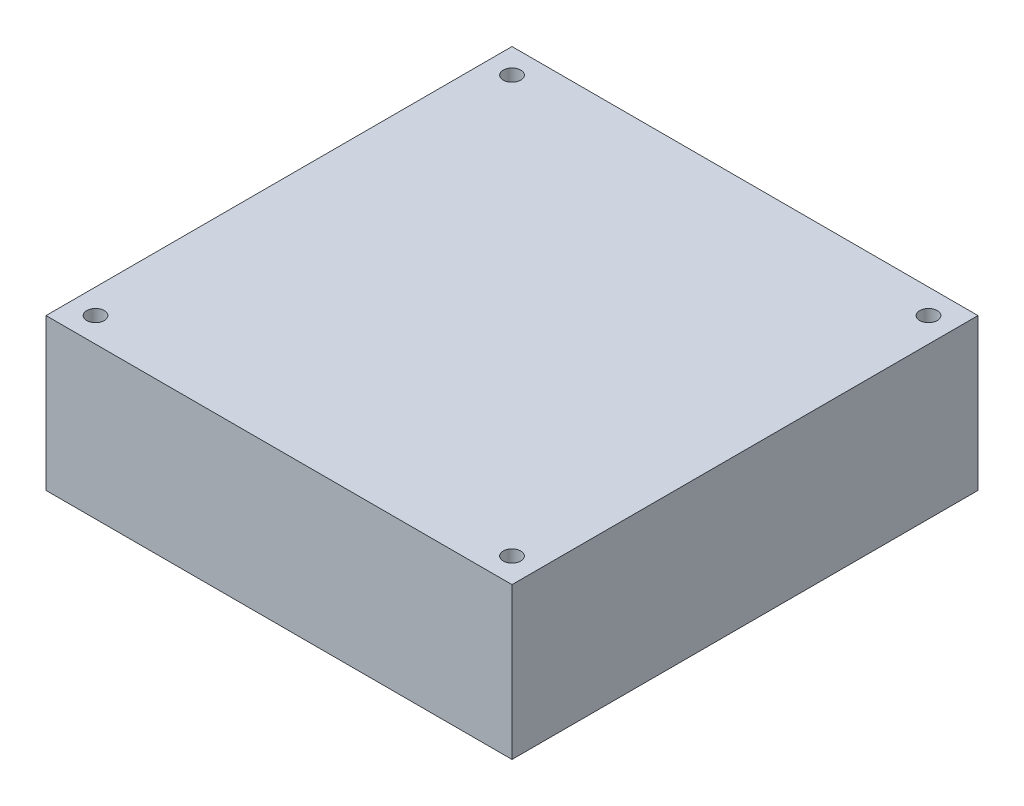
ISO-10303-21;
HEADER;
FILE_DESCRIPTION(('STEP AP214'),'2;1');
FILE_NAME('part.step','',(''),(''),'','','');
FILE_SCHEMA(('AUTOMOTIVE_DESIGN { 1 0 10303 214 1 1 1 1 }'));
ENDSEC;
DATA;
#1=APPLICATION_CONTEXT('core data for automotive mechanical design processes');
#2=APPLICATION_PROTOCOL_DEFINITION('international standard','automotive_design',2000,#1);
#3=PRODUCT_CONTEXT('',#1,'mechanical');
#4=PRODUCT('Part','Part','',(#3));
#5=PRODUCT_RELATED_PRODUCT_CATEGORY('part','',(#4));
#6=PRODUCT_DEFINITION_FORMATION('','',#4);
#7=PRODUCT_DEFINITION_CONTEXT('part definition',#1,'design');
#8=PRODUCT_DEFINITION('design','',#6,#7);
#9=PRODUCT_DEFINITION_SHAPE('','',#8);
#10=(LENGTH_UNIT() NAMED_UNIT(*) SI_UNIT(.MILLI.,.METRE.));
#11=(NAMED_UNIT(*) PLANE_ANGLE_UNIT() SI_UNIT($,.RADIAN.));
#12=(NAMED_UNIT(*) SI_UNIT($,.STERADIAN.) SOLID_ANGLE_UNIT());
#13=UNCERTAINTY_MEASURE_WITH_UNIT(LENGTH_MEASURE(1.E-05),#10,'distance_accuracy_value','');
#14=(GEOMETRIC_REPRESENTATION_CONTEXT(3) GLOBAL_UNCERTAINTY_ASSIGNED_CONTEXT((#13)) GLOBAL_UNIT_ASSIGNED_CONTEXT((#10,
#11,#12)) REPRESENTATION_CONTEXT('',''));
#15=CARTESIAN_POINT('',(0.,0.,0.));
#16=DIRECTION('',(0.,0.,1.));
#17=DIRECTION('',(1.,0.,0.));
#18=AXIS2_PLACEMENT_3D('',#15,#16,#17);
#19=CARTESIAN_POINT('',(0.,26.,0.));
#20=DIRECTION('',(0.,-1.,0.));
#21=DIRECTION('',(0.,0.,-1.));
#22=AXIS2_PLACEMENT_3D('',#19,#20,#21);
#23=PLANE('',#22);
#24=DIRECTION('',(0.,0.,-1.));
#25=VECTOR('',#24,1.);
#26=CARTESIAN_POINT('',(40.,26.,40.));
#27=LINE('',#26,#25);
#28=CARTESIAN_POINT('',(40.,26.,40.));
#29=VERTEX_POINT('',#28);
#30=CARTESIAN_POINT('',(40.,26.,-40.));
#31=VERTEX_POINT('',#30);
#32=EDGE_CURVE('E88',#29,#31,#27,.T.);
#33=ORIENTED_EDGE('',*,*,#32,.T.);
#34=DIRECTION('',(-1.,0.,0.));
#35=VECTOR('',#34,1.);
#36=CARTESIAN_POINT('',(-40.,26.,-40.));
#37=LINE('',#36,#35);
#38=CARTESIAN_POINT('',(-40.,26.,-40.));
#39=VERTEX_POINT('',#38);
#40=EDGE_CURVE('E83',#31,#39,#37,.T.);
#41=ORIENTED_EDGE('',*,*,#40,.T.);
#42=DIRECTION('',(0.,0.,1.));
#43=VECTOR('',#42,1.);
#44=CARTESIAN_POINT('',(-40.,26.,40.));
#45=LINE('',#44,#43);
#46=CARTESIAN_POINT('',(-40.,26.,40.));
#47=VERTEX_POINT('',#46);
#48=EDGE_CURVE('E86',#39,#47,#45,.T.);
#49=ORIENTED_EDGE('',*,*,#48,.T.);
#50=DIRECTION('',(1.,0.,0.));
#51=VECTOR('',#50,1.);
#52=CARTESIAN_POINT('',(-40.,26.,40.));
#53=LINE('',#52,#51);
#54=EDGE_CURVE('E53',#47,#29,#53,.T.);
#55=ORIENTED_EDGE('',*,*,#54,.T.);
#56=EDGE_LOOP('',(#33,#41,#49,#55));
#57=FACE_BOUND('',#56,.T.);
#58=CARTESIAN_POINT('',(35.75,26.,-35.75));
#59=DIRECTION('',(0.,1.,0.));
#60=DIRECTION('',(0.,0.,1.));
#61=AXIS2_PLACEMENT_3D('',#58,#59,#60);
#62=CIRCLE('',#61,1.5);
#63=CARTESIAN_POINT('',(35.75,26.,-34.25));
#64=VERTEX_POINT('',#63);
#65=EDGE_CURVE('E103',#64,#64,#62,.T.);
#66=ORIENTED_EDGE('',*,*,#65,.F.);
#67=EDGE_LOOP('',(#66));
#68=FACE_BOUND('',#67,.T.);
#69=CARTESIAN_POINT('',(-35.75,26.,-35.75));
#70=DIRECTION('',(0.,1.,0.));
#71=DIRECTION('',(0.,0.,1.));
#72=AXIS2_PLACEMENT_3D('',#69,#70,#71);
#73=CIRCLE('',#72,1.5);
#74=CARTESIAN_POINT('',(-35.75,26.,-34.25));
#75=VERTEX_POINT('',#74);
#76=EDGE_CURVE('E118',#75,#75,#73,.T.);
#77=ORIENTED_EDGE('',*,*,#76,.F.);
#78=EDGE_LOOP('',(#77));
#79=FACE_BOUND('',#78,.T.);
#80=CARTESIAN_POINT('',(-35.75,26.,35.75));
#81=DIRECTION('',(0.,1.,0.));
#82=DIRECTION('',(0.,0.,1.));
#83=AXIS2_PLACEMENT_3D('',#80,#81,#82);
#84=CIRCLE('',#83,1.5);
#85=CARTESIAN_POINT('',(-35.75,26.,37.25));
#86=VERTEX_POINT('',#85);
#87=EDGE_CURVE('E124',#86,#86,#84,.T.);
#88=ORIENTED_EDGE('',*,*,#87,.F.);
#89=EDGE_LOOP('',(#88));
#90=FACE_BOUND('',#89,.T.);
#91=CARTESIAN_POINT('',(35.75,26.,35.75));
#92=DIRECTION('',(0.,1.,0.));
#93=DIRECTION('',(0.,0.,1.));
#94=AXIS2_PLACEMENT_3D('',#91,#92,#93);
#95=CIRCLE('',#94,1.5);
#96=CARTESIAN_POINT('',(35.75,26.,37.25));
#97=VERTEX_POINT('',#96);
#98=EDGE_CURVE('E130',#97,#97,#95,.T.);
#99=ORIENTED_EDGE('',*,*,#98,.F.);
#100=EDGE_LOOP('',(#99));
#101=FACE_BOUND('',#100,.T.);
#102=ADVANCED_FACE('F36',(#57,#68,#79,#90,#101),#23,.F.);
#103=CARTESIAN_POINT('',(0.,0.,0.));
#104=DIRECTION('',(0.,-1.,0.));
#105=DIRECTION('',(0.,0.,-1.));
#106=AXIS2_PLACEMENT_3D('',#103,#104,#105);
#107=PLANE('',#106);
#108=CARTESIAN_POINT('',(-35.75,0.,35.75));
#109=DIRECTION('',(0.,1.,0.));
#110=DIRECTION('',(0.,0.,1.));
#111=AXIS2_PLACEMENT_3D('',#108,#109,#110);
#112=CIRCLE('',#111,1.5);
#113=CARTESIAN_POINT('',(-35.75,0.,37.25));
#114=VERTEX_POINT('',#113);
#115=EDGE_CURVE('E127',#114,#114,#112,.T.);
#116=ORIENTED_EDGE('',*,*,#115,.T.);
#117=EDGE_LOOP('',(#116));
#118=FACE_BOUND('',#117,.T.);
#119=CARTESIAN_POINT('',(35.75,0.,-35.75));
#120=DIRECTION('',(0.,1.,0.));
#121=DIRECTION('',(0.,0.,1.));
#122=AXIS2_PLACEMENT_3D('',#119,#120,#121);
#123=CIRCLE('',#122,1.5);
#124=CARTESIAN_POINT('',(35.75,0.,-34.25));
#125=VERTEX_POINT('',#124);
#126=EDGE_CURVE('E115',#125,#125,#123,.T.);
#127=ORIENTED_EDGE('',*,*,#126,.T.);
#128=EDGE_LOOP('',(#127));
#129=FACE_BOUND('',#128,.T.);
#130=DIRECTION('',(0.,0.,-1.));
#131=VECTOR('',#130,1.);
#132=CARTESIAN_POINT('',(40.,0.,40.));
#133=LINE('',#132,#131);
#134=CARTESIAN_POINT('',(40.,0.,40.));
#135=VERTEX_POINT('',#134);
#136=CARTESIAN_POINT('',(40.,0.,-40.));
#137=VERTEX_POINT('',#136);
#138=EDGE_CURVE('E100',#135,#137,#133,.T.);
#139=ORIENTED_EDGE('',*,*,#138,.F.);
#140=DIRECTION('',(1.,0.,0.));
#141=VECTOR('',#140,1.);
#142=CARTESIAN_POINT('',(-40.,0.,40.));
#143=LINE('',#142,#141);
#144=CARTESIAN_POINT('',(-40.,0.,40.));
#145=VERTEX_POINT('',#144);
#146=EDGE_CURVE('E76',#145,#135,#143,.T.);
#147=ORIENTED_EDGE('',*,*,#146,.F.);
#148=DIRECTION('',(0.,0.,1.));
#149=VECTOR('',#148,1.);
#150=CARTESIAN_POINT('',(-40.,0.,40.));
#151=LINE('',#150,#149);
#152=CARTESIAN_POINT('',(-40.,0.,-40.));
#153=VERTEX_POINT('',#152);
#154=EDGE_CURVE('E70',#153,#145,#151,.T.);
#155=ORIENTED_EDGE('',*,*,#154,.F.);
#156=DIRECTION('',(-1.,0.,0.));
#157=VECTOR('',#156,1.);
#158=CARTESIAN_POINT('',(-40.,0.,-40.));
#159=LINE('',#158,#157);
#160=EDGE_CURVE('E92',#137,#153,#159,.T.);
#161=ORIENTED_EDGE('',*,*,#160,.F.);
#162=EDGE_LOOP('',(#139,#147,#155,#161));
#163=FACE_BOUND('',#162,.T.);
#164=CARTESIAN_POINT('',(-35.75,0.,-35.75));
#165=DIRECTION('',(0.,1.,0.));
#166=DIRECTION('',(0.,0.,1.));
#167=AXIS2_PLACEMENT_3D('',#164,#165,#166);
#168=CIRCLE('',#167,1.5);
#169=CARTESIAN_POINT('',(-35.75,0.,-34.25));
#170=VERTEX_POINT('',#169);
#171=EDGE_CURVE('E121',#170,#170,#168,.T.);
#172=ORIENTED_EDGE('',*,*,#171,.T.);
#173=EDGE_LOOP('',(#172));
#174=FACE_BOUND('',#173,.T.);
#175=CARTESIAN_POINT('',(35.75,0.,35.75));
#176=DIRECTION('',(0.,1.,0.));
#177=DIRECTION('',(0.,0.,1.));
#178=AXIS2_PLACEMENT_3D('',#175,#176,#177);
#179=CIRCLE('',#178,1.5);
#180=CARTESIAN_POINT('',(35.75,0.,37.25));
#181=VERTEX_POINT('',#180);
#182=EDGE_CURVE('E133',#181,#181,#179,.T.);
#183=ORIENTED_EDGE('',*,*,#182,.T.);
#184=EDGE_LOOP('',(#183));
#185=FACE_BOUND('',#184,.T.);
#186=ADVANCED_FACE('F111',(#118,#129,#163,#174,#185),#107,.T.);
#187=CARTESIAN_POINT('',(40.,26.,40.));
#188=DIRECTION('',(-1.,0.,0.));
#189=DIRECTION('',(0.,0.,1.));
#190=AXIS2_PLACEMENT_3D('',#187,#188,#189);
#191=PLANE('',#190);
#192=ORIENTED_EDGE('',*,*,#138,.T.);
#193=DIRECTION('',(0.,-1.,0.));
#194=VECTOR('',#193,1.);
#195=CARTESIAN_POINT('',(40.,26.,-40.));
#196=LINE('',#195,#194);
#197=EDGE_CURVE('E11',#31,#137,#196,.T.);
#198=ORIENTED_EDGE('',*,*,#197,.F.);
#199=ORIENTED_EDGE('',*,*,#32,.F.);
#200=DIRECTION('',(0.,-1.,0.));
#201=VECTOR('',#200,1.);
#202=CARTESIAN_POINT('',(40.,26.,40.));
#203=LINE('',#202,#201);
#204=EDGE_CURVE('E96',#29,#135,#203,.T.);
#205=ORIENTED_EDGE('',*,*,#204,.T.);
#206=EDGE_LOOP('',(#192,#198,#199,#205));
#207=FACE_BOUND('',#206,.T.);
#208=ADVANCED_FACE('F38',(#207),#191,.F.);
#209=CARTESIAN_POINT('',(-40.,26.,-40.));
#210=DIRECTION('',(0.,0.,1.));
#211=DIRECTION('',(1.,0.,0.));
#212=AXIS2_PLACEMENT_3D('',#209,#210,#211);
#213=PLANE('',#212);
#214=ORIENTED_EDGE('',*,*,#160,.T.);
#215=DIRECTION('',(0.,-1.,0.));
#216=VECTOR('',#215,1.);
#217=CARTESIAN_POINT('',(-40.,26.,-40.));
#218=LINE('',#217,#216);
#219=EDGE_CURVE('E45',#39,#153,#218,.T.);
#220=ORIENTED_EDGE('',*,*,#219,.F.);
#221=ORIENTED_EDGE('',*,*,#40,.F.);
#222=ORIENTED_EDGE('',*,*,#197,.T.);
#223=EDGE_LOOP('',(#214,#220,#221,#222));
#224=FACE_BOUND('',#223,.T.);
#225=ADVANCED_FACE('F91',(#224),#213,.F.);
#226=CARTESIAN_POINT('',(-40.,26.,40.));
#227=DIRECTION('',(1.,0.,0.));
#228=DIRECTION('',(0.,0.,-1.));
#229=AXIS2_PLACEMENT_3D('',#226,#227,#228);
#230=PLANE('',#229);
#231=ORIENTED_EDGE('',*,*,#154,.T.);
#232=DIRECTION('',(0.,-1.,0.));
#233=VECTOR('',#232,1.);
#234=CARTESIAN_POINT('',(-40.,26.,40.));
#235=LINE('',#234,#233);
#236=EDGE_CURVE('E93',#47,#145,#235,.T.);
#237=ORIENTED_EDGE('',*,*,#236,.F.);
#238=ORIENTED_EDGE('',*,*,#48,.F.);
#239=ORIENTED_EDGE('',*,*,#219,.T.);
#240=EDGE_LOOP('',(#231,#237,#238,#239));
#241=FACE_BOUND('',#240,.T.);
#242=ADVANCED_FACE('F94',(#241),#230,.F.);
#243=CARTESIAN_POINT('',(-40.,26.,40.));
#244=DIRECTION('',(0.,0.,-1.));
#245=DIRECTION('',(-1.,0.,0.));
#246=AXIS2_PLACEMENT_3D('',#243,#244,#245);
#247=PLANE('',#246);
#248=ORIENTED_EDGE('',*,*,#146,.T.);
#249=ORIENTED_EDGE('',*,*,#204,.F.);
#250=ORIENTED_EDGE('',*,*,#54,.F.);
#251=ORIENTED_EDGE('',*,*,#236,.T.);
#252=EDGE_LOOP('',(#248,#249,#250,#251));
#253=FACE_BOUND('',#252,.T.);
#254=ADVANCED_FACE('F108',(#253),#247,.F.);
#255=CARTESIAN_POINT('',(35.75,26.,-35.75));
#256=DIRECTION('',(0.,-1.,0.));
#257=DIRECTION('',(0.,0.,-1.));
#258=AXIS2_PLACEMENT_3D('',#255,#256,#257);
#259=CYLINDRICAL_SURFACE('',#258,1.5);
#260=ORIENTED_EDGE('',*,*,#65,.T.);
#261=EDGE_LOOP('',(#260));
#262=FACE_BOUND('',#261,.T.);
#263=ORIENTED_EDGE('',*,*,#126,.F.);
#264=EDGE_LOOP('',(#263));
#265=FACE_BOUND('',#264,.T.);
#266=ADVANCED_FACE('F150',(#262,#265),#259,.F.);
#267=CARTESIAN_POINT('',(-35.75,26.,-35.75));
#268=DIRECTION('',(0.,-1.,0.));
#269=DIRECTION('',(0.,0.,-1.));
#270=AXIS2_PLACEMENT_3D('',#267,#268,#269);
#271=CYLINDRICAL_SURFACE('',#270,1.5);
#272=ORIENTED_EDGE('',*,*,#76,.T.);
#273=EDGE_LOOP('',(#272));
#274=FACE_BOUND('',#273,.T.);
#275=ORIENTED_EDGE('',*,*,#171,.F.);
#276=EDGE_LOOP('',(#275));
#277=FACE_BOUND('',#276,.T.);
#278=ADVANCED_FACE('F198',(#274,#277),#271,.F.);
#279=CARTESIAN_POINT('',(-35.75,26.,35.75));
#280=DIRECTION('',(0.,-1.,0.));
#281=DIRECTION('',(0.,0.,-1.));
#282=AXIS2_PLACEMENT_3D('',#279,#280,#281);
#283=CYLINDRICAL_SURFACE('',#282,1.5);
#284=ORIENTED_EDGE('',*,*,#87,.T.);
#285=EDGE_LOOP('',(#284));
#286=FACE_BOUND('',#285,.T.);
#287=ORIENTED_EDGE('',*,*,#115,.F.);
#288=EDGE_LOOP('',(#287));
#289=FACE_BOUND('',#288,.T.);
#290=ADVANCED_FACE('F206',(#286,#289),#283,.F.);
#291=CARTESIAN_POINT('',(35.75,26.,35.75));
#292=DIRECTION('',(0.,-1.,0.));
#293=DIRECTION('',(0.,0.,-1.));
#294=AXIS2_PLACEMENT_3D('',#291,#292,#293);
#295=CYLINDRICAL_SURFACE('',#294,1.5);
#296=ORIENTED_EDGE('',*,*,#98,.T.);
#297=EDGE_LOOP('',(#296));
#298=FACE_BOUND('',#297,.T.);
#299=ORIENTED_EDGE('',*,*,#182,.F.);
#300=EDGE_LOOP('',(#299));
#301=FACE_BOUND('',#300,.T.);
#302=ADVANCED_FACE('F139',(#298,#301),#295,.F.);
#303=CLOSED_SHELL('',(#102,#186,#208,#225,#242,#254,#266,#278,#290,#302));
#304=MANIFOLD_SOLID_BREP('B2',#303);
#305=ADVANCED_BREP_SHAPE_REPRESENTATION('',(#18,#304),#14);
#306=SHAPE_DEFINITION_REPRESENTATION(#9,#305);
ENDSEC;
END-ISO-10303-21;
